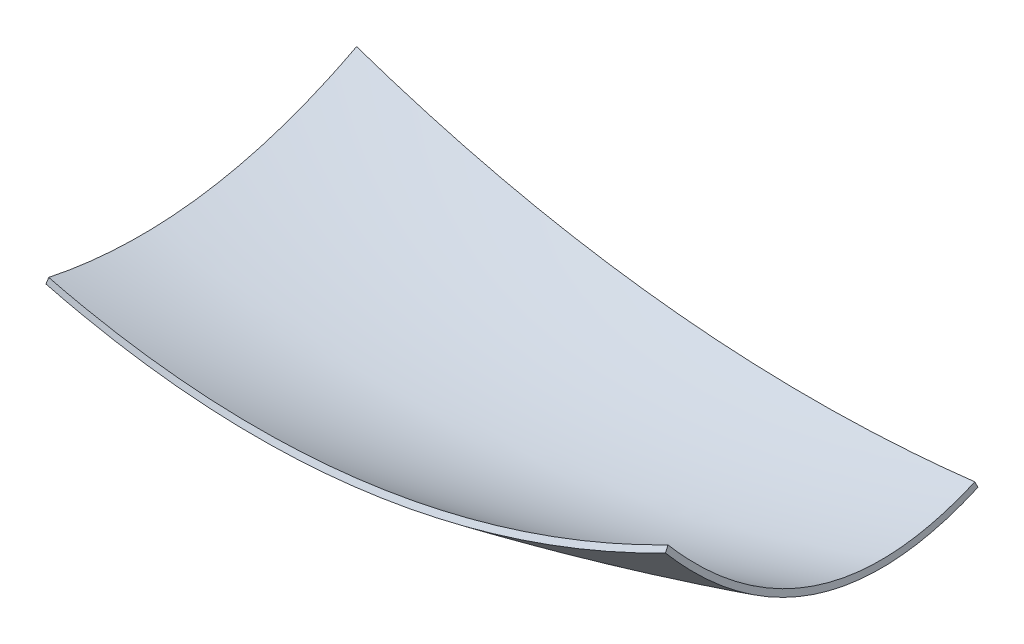
ISO-10303-21;
HEADER;
FILE_DESCRIPTION(('STEP AP214'),'2;1');
FILE_NAME('part.step','',(''),(''),'','','');
FILE_SCHEMA(('AUTOMOTIVE_DESIGN { 1 0 10303 214 1 1 1 1 }'));
ENDSEC;
DATA;
#1=APPLICATION_CONTEXT('core data for automotive mechanical design processes');
#2=APPLICATION_PROTOCOL_DEFINITION('international standard','automotive_design',2000,#1);
#3=PRODUCT_CONTEXT('',#1,'mechanical');
#4=PRODUCT('Part','Part','',(#3));
#5=PRODUCT_RELATED_PRODUCT_CATEGORY('part','',(#4));
#6=PRODUCT_DEFINITION_FORMATION('','',#4);
#7=PRODUCT_DEFINITION_CONTEXT('part definition',#1,'design');
#8=PRODUCT_DEFINITION('design','',#6,#7);
#9=PRODUCT_DEFINITION_SHAPE('','',#8);
#10=(LENGTH_UNIT() NAMED_UNIT(*) SI_UNIT(.MILLI.,.METRE.));
#11=(NAMED_UNIT(*) PLANE_ANGLE_UNIT() SI_UNIT($,.RADIAN.));
#12=(NAMED_UNIT(*) SI_UNIT($,.STERADIAN.) SOLID_ANGLE_UNIT());
#13=UNCERTAINTY_MEASURE_WITH_UNIT(LENGTH_MEASURE(1.E-05),#10,'distance_accuracy_value','');
#14=(GEOMETRIC_REPRESENTATION_CONTEXT(3) GLOBAL_UNCERTAINTY_ASSIGNED_CONTEXT((#13)) GLOBAL_UNIT_ASSIGNED_CONTEXT((#10,
#11,#12)) REPRESENTATION_CONTEXT('',''));
#15=CARTESIAN_POINT('',(0.,0.,0.));
#16=DIRECTION('',(0.,0.,1.));
#17=DIRECTION('',(1.,0.,0.));
#18=AXIS2_PLACEMENT_3D('',#15,#16,#17);
#19=CARTESIAN_POINT('',(-0.240450892228312,-15.9506363595677,100.196147598238));
#20=CARTESIAN_POINT('',(16.667973380551,-20.217375557981,100.244724709791));
#21=CARTESIAN_POINT('',(33.5342554283378,-22.8881582504063,100.298336195862));
#22=CARTESIAN_POINT('',(67.171108901754,-25.0344979123883,100.405103156816));
#23=CARTESIAN_POINT('',(83.941331729766,-24.5101294872349,100.45791102342));
#24=CARTESIAN_POINT('',(134.092025747913,-18.1570760055417,100.600563138446));
#25=CARTESIAN_POINT('',(167.310954500797,-7.55167536274053,100.672080376917));
#26=CARTESIAN_POINT('',(200.314709909604,9.384565928065,100.722633085251));
#27=CARTESIAN_POINT('',(0.240450892228312,-14.0493636404324,99.8038524017619));
#28=CARTESIAN_POINT('',(17.0328303803854,-18.3067969935756,99.7552751392524));
#29=CARTESIAN_POINT('',(33.7754854719089,-20.9874772428553,99.7016638041382));
#30=CARTESIAN_POINT('',(67.1727696557765,-23.1986435770229,99.5948968431844));
#31=CARTESIAN_POINT('',(83.8277479087521,-22.7290551678803,99.5420889765796));
#32=CARTESIAN_POINT('',(133.677053890606,-16.5821086495735,99.3994368615544));
#33=CARTESIAN_POINT('',(166.757322539406,-6.1633300778308,99.3279244513734));
#34=CARTESIAN_POINT('',(199.685290090396,10.615434071935,99.2773669147494));
#35=B_SPLINE_SURFACE_WITH_KNOTS('',1,3,((#19,#20,#21,#22,#23,#24,#25,#26),(#27,#28,#29,#30,#31,
#32,#33,#34)),.UNSPECIFIED.,.F.,.F.,.F.,(2,2),(4,2,2,4),(0.,1.),(0.,0.25,0.5,1.),.UNSPECIFIED.);
#36=CARTESIAN_POINT('',(199.685290090396,10.615434071935,99.2773669147494));
#37=CARTESIAN_POINT('',(200.314709909604,9.384565928065,100.722633085251));
#38=B_SPLINE_CURVE_WITH_KNOTS('',1,(#36,#37),.UNSPECIFIED.,.F.,.F.,(2,2),(0.,1.),.UNSPECIFIED.);
#39=CARTESIAN_POINT('',(199.685290090396,10.615434071935,99.2773669147494));
#40=VERTEX_POINT('',#39);
#41=CARTESIAN_POINT('',(200.314709909546,9.38456587257243,100.722633038015));
#42=VERTEX_POINT('',#41);
#43=EDGE_CURVE('E12',#40,#42,#38,.T.);
#44=CARTESIAN_POINT('',(199.685290090396,10.615434071935,99.2773669147494));
#45=CARTESIAN_POINT('',(166.757322539406,-6.1633300778308,99.3279244513734));
#46=CARTESIAN_POINT('',(133.677053890606,-16.5821086495735,99.3994368615544));
#47=CARTESIAN_POINT('',(83.8277479087521,-22.7290551678803,99.5420889765796));
#48=CARTESIAN_POINT('',(67.1727696557765,-23.1986435770229,99.5948968431844));
#49=CARTESIAN_POINT('',(33.7754854719089,-20.9874772428553,99.7016638041382));
#50=CARTESIAN_POINT('',(17.0328303803854,-18.3067969935756,99.7552751392524));
#51=CARTESIAN_POINT('',(0.240450892228312,-14.0493636404324,99.8038524017619));
#52=B_SPLINE_CURVE_WITH_KNOTS('',3,(#44,#45,#46,#47,#48,#49,#50,#51),.UNSPECIFIED.,.F.,.F.,(4,2,
2,4),(0.,0.5,0.75,1.),.UNSPECIFIED.);
#53=CARTESIAN_POINT('',(0.240450892228312,-14.0493636404324,99.8038524017619));
#54=VERTEX_POINT('',#53);
#55=EDGE_CURVE('E108',#40,#54,#52,.T.);
#56=CARTESIAN_POINT('',(0.240450892228312,-14.0493636404324,99.8038524017619));
#57=CARTESIAN_POINT('',(-0.240450892228312,-15.9506363595677,100.196147598238));
#58=B_SPLINE_CURVE_WITH_KNOTS('',1,(#56,#57),.UNSPECIFIED.,.F.,.F.,(2,2),(0.,1.),.UNSPECIFIED.);
#59=CARTESIAN_POINT('',(-0.240450790777608,-15.9506363851681,100.19614759853));
#60=VERTEX_POINT('',#59);
#61=EDGE_CURVE('E57',#54,#60,#58,.T.);
#62=CARTESIAN_POINT('',(200.31470990957,9.38456592810045,100.722633085295));
#63=CARTESIAN_POINT('',(196.225848411361,7.28624087256167,100.716370100882));
#64=CARTESIAN_POINT('',(192.096388438844,5.26613141934796,100.709764467273));
#65=CARTESIAN_POINT('',(183.829587331551,1.42689544369586,100.69590860702));
#66=CARTESIAN_POINT('',(179.693551012241,-0.395043699056741,100.688671114729));
#67=CARTESIAN_POINT('',(171.413473321552,-3.8379909130129,100.67350437714));
#68=CARTESIAN_POINT('',(167.27054605294,-5.46167181121158,100.665587568204));
#69=CARTESIAN_POINT('',(158.976902402566,-8.5081350081568,100.649023608417));
#70=CARTESIAN_POINT('',(154.827100634811,-9.93340353182142,100.640388184399));
#71=CARTESIAN_POINT('',(146.519858006989,-12.5831099928884,100.622360995433));
#72=CARTESIAN_POINT('',(142.363136289723,-13.8097985223704,100.612979816592));
#73=CARTESIAN_POINT('',(134.042242934901,-16.0624371466394,100.593453229332));
#74=CARTESIAN_POINT('',(129.878604614255,-17.0903538585643,100.583316847237));
#75=CARTESIAN_POINT('',(121.544077106487,-18.9455717639689,100.562295473889));
#76=CARTESIAN_POINT('',(117.373552916014,-19.774509875599,100.551417608118));
#77=CARTESIAN_POINT('',(109.025467200767,-21.2319270540693,100.528957233824));
#78=CARTESIAN_POINT('',(104.848127150694,-21.861672617712,100.517379758537));
#79=CARTESIAN_POINT('',(96.4866316008513,-22.9208992328547,100.493595750127));
#80=CARTESIAN_POINT('',(92.3025855485172,-23.3512429180196,100.48139218522));
#81=CARTESIAN_POINT('',(83.9279023827929,-24.0119026932036,100.456463967275));
#82=CARTESIAN_POINT('',(79.737299601611,-24.2426534316933,100.44374051004));
#83=CARTESIAN_POINT('',(71.3497219054347,-24.5044093583796,100.4179104125));
#84=CARTESIAN_POINT('',(67.152746785232,-24.535407971384,100.404803759595));
#85=CARTESIAN_POINT('',(58.7526260077482,-24.3979894602824,100.378369102123));
#86=CARTESIAN_POINT('',(54.5494877399141,-24.2291230865719,100.365040665535));
#87=CARTESIAN_POINT('',(46.1372207866133,-23.6923426634323,100.338339472178));
#88=CARTESIAN_POINT('',(41.9281485280823,-23.3235471292087,100.324966781769));
#89=CARTESIAN_POINT('',(33.5041362243324,-22.3873328058061,100.298357463925));
#90=CARTESIAN_POINT('',(29.289340048204,-21.8186220988083,100.285122312293));
#91=CARTESIAN_POINT('',(20.8540328065692,-20.4829515451717,100.258964089666));
#92=CARTESIAN_POINT('',(16.6337873558079,-19.7143202737896,100.246044705933));
#93=CARTESIAN_POINT('',(8.18739643212285,-17.9794769489942,100.220666186345));
#94=CARTESIAN_POINT('',(3.96166296785649,-17.0112561173583,100.20821338392));
#95=CARTESIAN_POINT('',(-0.240450790802508,-15.9506363851685,100.196147598497));
#96=B_SPLINE_CURVE_WITH_KNOTS('',3,(#62,#63,#64,#65,#66,#67,#68,#69,#70,#71,#72,#73,#74,#75,#76,
#77,#78,#79,#80,#81,#82,#83,#84,#85,#86,#87,#88,#89,#90,#91,#92,#93,#94,#95),.UNSPECIFIED.,.F.,
.F.,(4,2,2,2,2,2,2,2,2,2,2,2,2,2,2,2,4),(0.,13.7872899990256,27.3423043626341,40.6875803226944,
53.8467186875751,66.8443167378909,79.7058777207261,92.4576972777116,105.12672844843,
117.740428221349,130.326589803202,142.91316567857,155.52808703716,168.199085191354,
180.953520264933,193.818221769434,206.819344841686),.UNSPECIFIED.);
#97=EDGE_CURVE('E241',#42,#60,#96,.T.);
#98=ORIENTED_EDGE('',*,*,#43,.F.);
#99=ORIENTED_EDGE('',*,*,#55,.T.);
#100=ORIENTED_EDGE('',*,*,#61,.T.);
#101=ORIENTED_EDGE('',*,*,#97,.F.);
#102=EDGE_LOOP('',(#98,#99,#100,#101));
#103=FACE_BOUND('',#102,.T.);
#104=ADVANCED_FACE('F43',(#103),#35,.F.);
#105=CARTESIAN_POINT('',(-0.289234933847744,-0.848741702802646,-0.442697046484111));
#106=CARTESIAN_POINT('',(-0.316347178974317,-9.39637203453641,15.9625900201184));
#107=CARTESIAN_POINT('',(-0.331454459415653,-14.9328748732341,32.5583983938536));
#108=CARTESIAN_POINT('',(-0.319035946160587,-19.9703719113374,66.1129181275364));
#109=CARTESIAN_POINT('',(-0.290971228766199,-19.4712665494066,83.0713560778683));
#110=CARTESIAN_POINT('',(-0.240450892228312,-15.9506363595677,100.196147598238));
#111=CARTESIAN_POINT('',(0.289234933847744,0.848741702802646,0.442697046484111));
#112=CARTESIAN_POINT('',(0.316347858508359,-7.62556932409039,16.6719879873977));
#113=CARTESIAN_POINT('',(0.331454459415653,-13.1000367081252,33.060135074685));
#114=CARTESIAN_POINT('',(0.319035946160587,-18.0625396700219,66.1722820076688));
#115=CARTESIAN_POINT('',(0.290970413259953,-17.5506747329086,82.8965530183005));
#116=CARTESIAN_POINT('',(0.240450892228312,-14.0493636404324,99.8038524017619));
#117=B_SPLINE_SURFACE_WITH_KNOTS('',1,3,((#105,#106,#107,#108,#109,#110),(#111,#112,#113,#114,
#115,#116)),.UNSPECIFIED.,.F.,.F.,.F.,(2,2),(4,2,4),(0.,1.),(0.,0.5,1.),.UNSPECIFIED.);
#118=CARTESIAN_POINT('',(0.240450892228312,-14.0493636404324,99.8038524017619));
#119=CARTESIAN_POINT('',(0.290970413259953,-17.5506747329086,82.8965530183005));
#120=CARTESIAN_POINT('',(0.319035946160587,-18.0625396700219,66.1722820076688));
#121=CARTESIAN_POINT('',(0.331454459415653,-13.1000367081252,33.060135074685));
#122=CARTESIAN_POINT('',(0.316347858508359,-7.62556932409039,16.6719879873977));
#123=CARTESIAN_POINT('',(0.289234933847744,0.848741702802646,0.442697046484111));
#124=B_SPLINE_CURVE_WITH_KNOTS('',3,(#118,#119,#120,#121,#122,#123),.UNSPECIFIED.,.F.,.F.,(4,2,
4),(0.,0.5,1.),.UNSPECIFIED.);
#125=CARTESIAN_POINT('',(0.289234933847744,0.848741702802646,0.442697046484111));
#126=VERTEX_POINT('',#125);
#127=EDGE_CURVE('E274',#54,#126,#124,.T.);
#128=CARTESIAN_POINT('',(0.289234933847744,0.848741702802646,0.442697046484111));
#129=CARTESIAN_POINT('',(-0.289234933847744,-0.848741702802646,-0.442697046484111));
#130=B_SPLINE_CURVE_WITH_KNOTS('',1,(#128,#129),.UNSPECIFIED.,.F.,.F.,(2,2),(0.,1.),.UNSPECIFIED.);
#131=CARTESIAN_POINT('',(-0.289234933929082,-0.848741728445857,-0.442696997267637));
#132=VERTEX_POINT('',#131);
#133=EDGE_CURVE('E98',#126,#132,#130,.T.);
#134=CARTESIAN_POINT('',(-0.240450892249539,-15.9506363595662,100.196147598219));
#135=CARTESIAN_POINT('',(-0.24673448112138,-16.3885001999614,98.0668230093687));
#136=CARTESIAN_POINT('',(-0.252718968384161,-16.7818846438879,95.9282350497316));
#137=CARTESIAN_POINT('',(-0.263994123317448,-17.4733829764611,91.6561838504127));
#138=CARTESIAN_POINT('',(-0.269290737930506,-17.7723506723786,89.5228586333515));
#139=CARTESIAN_POINT('',(-0.279175577478166,-18.2750588026449,85.261372117682));
#140=CARTESIAN_POINT('',(-0.28376886913715,-18.4795040921332,83.1332943127297));
#141=CARTESIAN_POINT('',(-0.292241850220066,-18.7933614700195,78.882443055094));
#142=CARTESIAN_POINT('',(-0.29612549610789,-18.9033139575616,76.7597096105247));
#143=CARTESIAN_POINT('',(-0.303180023669967,-19.0283611249287,72.5196438800046));
#144=CARTESIAN_POINT('',(-0.306353601807746,-19.0438207387524,70.4023224227165));
#145=CARTESIAN_POINT('',(-0.311995294466947,-18.9800791620153,66.1731687137843));
#146=CARTESIAN_POINT('',(-0.3144647535844,-18.9010599095089,64.0613337350504));
#147=CARTESIAN_POINT('',(-0.31871130465091,-18.648563300119,59.843220425605));
#148=CARTESIAN_POINT('',(-0.320488364787757,-18.4750816040445,57.73694235462));
#149=CARTESIAN_POINT('',(-0.323368558512627,-18.0338669974491,53.5299912017827));
#150=CARTESIAN_POINT('',(-0.324470324783566,-17.7659445811905,51.4293380102448));
#151=CARTESIAN_POINT('',(-0.326023157703115,-17.1360540911338,47.2336648898516));
#152=CARTESIAN_POINT('',(-0.326471623169962,-16.7737168035838,45.1387004514872));
#153=CARTESIAN_POINT('',(-0.326745306634172,-15.9551964795578,40.9544137358969));
#154=CARTESIAN_POINT('',(-0.326566843483423,-15.4984740226142,38.8651971123707));
#155=CARTESIAN_POINT('',(-0.325617772072122,-14.4913734416823,34.6923970468655));
#156=CARTESIAN_POINT('',(-0.324842597595159,-13.9402987088835,32.6089819602862));
#157=CARTESIAN_POINT('',(-0.32273427477923,-12.7446703067243,28.4477592615672));
#158=CARTESIAN_POINT('',(-0.321395898011356,-12.0992786830822,26.370192752086));
#159=CARTESIAN_POINT('',(-0.318197857930121,-10.7151772046923,22.2206303075222));
#160=CARTESIAN_POINT('',(-0.316332541418188,-9.9755059250763,20.1489555381095));
#161=CARTESIAN_POINT('',(-0.312119196576766,-8.40298752098484,16.0111193553207));
#162=CARTESIAN_POINT('',(-0.309765328206598,-7.56907457816168,13.9453634998128));
#163=CARTESIAN_POINT('',(-0.30461506295662,-5.80819715954404,9.81933528224424));
#164=CARTESIAN_POINT('',(-0.30181287023094,-4.88008198159017,7.75955503550428));
#165=CARTESIAN_POINT('',(-0.295806224763748,-2.93090083090444,3.64530721839388));
#166=CARTESIAN_POINT('',(-0.292596216667505,-1.90861841292519,1.59141544361836));
#167=CARTESIAN_POINT('',(-0.289234933847744,-0.848741702802647,-0.442697046484111));
#168=B_SPLINE_CURVE_WITH_KNOTS('',3,(#134,#135,#136,#137,#138,#139,#140,#141,#142,#143,#144,
#145,#146,#147,#148,#149,#150,#151,#152,#153,#154,#155,#156,#157,#158,#159,#160,#161,#162,#163,
#164,#165,#166,#167),.UNSPECIFIED.,.F.,.F.,(4,2,2,2,2,2,2,2,2,2,2,2,2,2,2,2,4),(0.,
6.52135534117074,12.9819274967348,19.3935135486404,25.7681833299472,32.1182183307067,
38.4560447315841,44.7941622890072,51.1450710660689,57.5211981460807,63.9348264660549,
70.3980277628091,76.9226013551369,83.5200201204097,90.201384602487,96.9773857537946,
103.858276401534),.UNSPECIFIED.);
#169=EDGE_CURVE('E117',#60,#132,#168,.T.);
#170=ORIENTED_EDGE('',*,*,#61,.F.);
#171=ORIENTED_EDGE('',*,*,#127,.T.);
#172=ORIENTED_EDGE('',*,*,#133,.T.);
#173=ORIENTED_EDGE('',*,*,#169,.F.);
#174=EDGE_LOOP('',(#170,#171,#172,#173));
#175=FACE_BOUND('',#174,.T.);
#176=ADVANCED_FACE('F141',(#175),#117,.F.);
#177=CARTESIAN_POINT('',(-0.289234933847744,-0.848741702802646,-0.442697046484111));
#178=CARTESIAN_POINT('',(32.7105142481926,-12.0776672162289,-0.474824911043054));
#179=CARTESIAN_POINT('',(65.9088506199869,-19.5295880734227,-0.487661330814));
#180=CARTESIAN_POINT('',(132.705623056005,-26.8842454152936,-0.474967277200345));
#181=CARTESIAN_POINT('',(166.304431199708,-26.787263000037,-0.449381151782209));
#182=CARTESIAN_POINT('',(200.105063823266,-22.9109404311503,-0.398934987105015));
#183=CARTESIAN_POINT('',(0.289234933847744,0.848741702802646,0.442697046484111));
#184=CARTESIAN_POINT('',(33.1602576938958,-10.3698315525799,0.474824828660262));
#185=CARTESIAN_POINT('',(66.2306407639982,-17.8083268577765,0.487661330814));
#186=CARTESIAN_POINT('',(132.767201661314,-25.1203361825723,0.474967277200345));
#187=CARTESIAN_POINT('',(166.233007438638,-24.9935690396506,0.449380823359991));
#188=CARTESIAN_POINT('',(199.894936176734,-21.0890595688497,0.398934987105015));
#189=B_SPLINE_SURFACE_WITH_KNOTS('',1,3,((#177,#178,#179,#180,#181,#182),(#183,#184,#185,#186,
#187,#188)),.UNSPECIFIED.,.F.,.F.,.F.,(2,2),(4,2,4),(0.,1.),(0.,0.5,1.),.UNSPECIFIED.);
#190=CARTESIAN_POINT('',(0.289234933847744,0.848741702802646,0.442697046484111));
#191=CARTESIAN_POINT('',(33.1602576938958,-10.3698315525799,0.474824828660262));
#192=CARTESIAN_POINT('',(66.2306407639982,-17.8083268577765,0.487661330814));
#193=CARTESIAN_POINT('',(132.767201661314,-25.1203361825723,0.474967277200345));
#194=CARTESIAN_POINT('',(166.233007438638,-24.9935690396506,0.449380823359991));
#195=CARTESIAN_POINT('',(199.894936176734,-21.0890595688497,0.398934987105015));
#196=B_SPLINE_CURVE_WITH_KNOTS('',3,(#190,#191,#192,#193,#194,#195),.UNSPECIFIED.,.F.,.F.,(4,2,
4),(0.,0.5,1.),.UNSPECIFIED.);
#197=CARTESIAN_POINT('',(199.894936176734,-21.0890595688497,0.398934987105015));
#198=VERTEX_POINT('',#197);
#199=EDGE_CURVE('E106',#126,#198,#196,.T.);
#200=CARTESIAN_POINT('',(199.894936176734,-21.0890595688497,0.398934987105015));
#201=CARTESIAN_POINT('',(200.105063823266,-22.9109404311503,-0.398934987105015));
#202=B_SPLINE_CURVE_WITH_KNOTS('',1,(#200,#201),.UNSPECIFIED.,.F.,.F.,(2,2),(0.,1.),.UNSPECIFIED.);
#203=CARTESIAN_POINT('',(200.105063823381,-22.9109404545827,-0.398934933568342));
#204=VERTEX_POINT('',#203);
#205=EDGE_CURVE('E86',#198,#204,#202,.T.);
#206=CARTESIAN_POINT('',(-0.289234933847744,-0.848741702802647,-0.442697046484111));
#207=CARTESIAN_POINT('',(3.82109426534785,-2.2473944810153,-0.44669878450894));
#208=CARTESIAN_POINT('',(7.94947416489801,-3.59248909022675,-0.450409769575753));
#209=CARTESIAN_POINT('',(16.2126737567365,-6.16390529390171,-0.457220421770713));
#210=CARTESIAN_POINT('',(20.3472643616851,-7.39096329319814,-0.460324023756114));
#211=CARTESIAN_POINT('',(32.7260097664609,-10.8841572480732,-0.468704497105304));
#212=CARTESIAN_POINT('',(41.0170284741553,-12.9868246778691,-0.473121034379433));
#213=CARTESIAN_POINT('',(57.6249326733863,-16.7150251004494,-0.479553708763889));
#214=CARTESIAN_POINT('',(65.9408701648761,-18.3447900438647,-0.481591663043408));
#215=CARTESIAN_POINT('',(82.5986122566161,-21.1286353143795,-0.483259519038789));
#216=CARTESIAN_POINT('',(90.9399271156251,-22.2856363191629,-0.482904450671002));
#217=CARTESIAN_POINT('',(107.647948611145,-24.1252686093892,-0.479729212083859));
#218=CARTESIAN_POINT('',(116.014490245725,-24.8093961270015,-0.476916881501954));
#219=CARTESIAN_POINT('',(132.772612742679,-25.7047279770272,-0.468719574196784));
#220=CARTESIAN_POINT('',(141.164193269718,-25.9159386148143,-0.463334631775167));
#221=CARTESIAN_POINT('',(157.97289322968,-25.8667583921768,-0.449835983564949));
#222=CARTESIAN_POINT('',(166.390009519164,-25.6048742780862,-0.441713703619853));
#223=CARTESIAN_POINT('',(179.012195946345,-24.8607751467165,-0.427367537458308));
#224=CARTESIAN_POINT('',(183.228269877669,-24.5531313052548,-0.422211297820397));
#225=CARTESIAN_POINT('',(191.666754115364,-23.8202013623076,-0.411142742955453));
#226=CARTESIAN_POINT('',(195.889124996047,-23.3944610872396,-0.40522755716167));
#227=CARTESIAN_POINT('',(200.105063823277,-22.9109404311275,-0.398934987154219));
#228=B_SPLINE_CURVE_WITH_KNOTS('',3,(#206,#207,#208,#209,#210,#211,#212,#213,#214,#215,#216,
#217,#218,#219,#220,#221,#222,#223,#224,#225,#226,#227),.UNSPECIFIED.,.F.,.F.,(4,2,2,2,2,2,2,2,
2,2,4),(0.,13.0246061735627,25.9618172942494,51.6086677703219,77.0183804710459,102.268651146859,
127.438656428018,152.608326116929,177.857579001395,190.538052910407,203.267985952688),.UNSPECIFIED.);
#229=EDGE_CURVE('E99',#132,#204,#228,.T.);
#230=ORIENTED_EDGE('',*,*,#133,.F.);
#231=ORIENTED_EDGE('',*,*,#199,.T.);
#232=ORIENTED_EDGE('',*,*,#205,.T.);
#233=ORIENTED_EDGE('',*,*,#229,.F.);
#234=EDGE_LOOP('',(#230,#231,#232,#233));
#235=FACE_BOUND('',#234,.T.);
#236=ADVANCED_FACE('F113',(#235),#189,.T.);
#237=CARTESIAN_POINT('',(200.105063823266,-22.9109404311503,-0.398934987105015));
#238=CARTESIAN_POINT('',(200.12427426062,-26.8160649336257,8.52320580030753));
#239=CARTESIAN_POINT('',(200.147396985477,-29.0795275175004,17.3448243095272));
#240=CARTESIAN_POINT('',(200.194109593273,-30.2894181380685,34.7564841421142));
#241=CARTESIAN_POINT('',(200.217052897054,-29.2346148388965,43.3443980365698));
#242=CARTESIAN_POINT('',(200.254870326946,-23.8206077604866,60.2330405883778));
#243=CARTESIAN_POINT('',(200.269907250058,-19.4640268024272,68.5331313114066));
#244=CARTESIAN_POINT('',(200.29488156225,-7.48580568920374,84.8409026493506));
#245=CARTESIAN_POINT('',(200.305072598553,0.135987309860678,92.8502320598398));
#246=CARTESIAN_POINT('',(200.314709909604,9.384565928065,100.722633085251));
#247=CARTESIAN_POINT('',(199.894936176734,-21.0890595688497,0.398934987105015));
#248=CARTESIAN_POINT('',(199.875722964287,-24.9186559230341,9.13849319370989));
#249=CARTESIAN_POINT('',(199.852603014523,-27.1229007199023,17.7298170391096));
#250=CARTESIAN_POINT('',(199.805890406727,-28.3143976635642,34.646523691458));
#251=CARTESIAN_POINT('',(199.782947102946,-27.3028811871271,42.9740347515695));
#252=CARTESIAN_POINT('',(199.745129673054,-22.0502215988704,59.4187255330948));
#253=CARTESIAN_POINT('',(199.730092749942,-17.8064556658722,67.5365431888322));
#254=CARTESIAN_POINT('',(199.70511843775,-6.04995588153227,83.5670720326195));
#255=CARTESIAN_POINT('',(199.694927782748,1.4626252470796,91.4781343622328));
#256=CARTESIAN_POINT('',(199.685290090396,10.615434071935,99.2773669147494));
#257=B_SPLINE_SURFACE_WITH_KNOTS('',1,3,((#237,#238,#239,#240,#241,#242,#243,#244,#245,#246),
(#247,#248,#249,#250,#251,#252,#253,#254,#255,#256)),.UNSPECIFIED.,.F.,.F.,.F.,(2,2),(4,2,2,2,
4),(0.,1.),(0.,0.25,0.5,0.75,1.),.UNSPECIFIED.);
#258=CARTESIAN_POINT('',(199.894936176734,-21.0890595688497,0.398934987105015));
#259=CARTESIAN_POINT('',(199.875722964287,-24.9186559230341,9.13849319370989));
#260=CARTESIAN_POINT('',(199.852603014523,-27.1229007199023,17.7298170391096));
#261=CARTESIAN_POINT('',(199.805890406727,-28.3143976635642,34.646523691458));
#262=CARTESIAN_POINT('',(199.782947102946,-27.3028811871271,42.9740347515695));
#263=CARTESIAN_POINT('',(199.745129673054,-22.0502215988704,59.4187255330948));
#264=CARTESIAN_POINT('',(199.730092749942,-17.8064556658722,67.5365431888322));
#265=CARTESIAN_POINT('',(199.70511843775,-6.04995588153227,83.5670720326195));
#266=CARTESIAN_POINT('',(199.694927782748,1.4626252470796,91.4781343622328));
#267=CARTESIAN_POINT('',(199.685290090396,10.615434071935,99.2773669147494));
#268=B_SPLINE_CURVE_WITH_KNOTS('',3,(#258,#259,#260,#261,#262,#263,#264,#265,#266,#267),
.UNSPECIFIED.,.F.,.F.,(4,2,2,2,4),(0.,0.25,0.5,0.75,1.),.UNSPECIFIED.);
#269=EDGE_CURVE('E88',#198,#40,#268,.T.);
#270=CARTESIAN_POINT('',(200.105063823277,-22.9109404311275,-0.398934987154219));
#271=CARTESIAN_POINT('',(200.107441907051,-23.3944936593441,0.705828968660073));
#272=CARTESIAN_POINT('',(200.109898295316,-23.8575371546059,1.81969168525016));
#273=CARTESIAN_POINT('',(200.114917519408,-24.7314283473388,4.04446111792675));
#274=CARTESIAN_POINT('',(200.117477626313,-25.1430686342378,5.15505690653546));
#275=CARTESIAN_POINT('',(200.122696107765,-25.9141222855495,7.37329411551453));
#276=CARTESIAN_POINT('',(200.125352095092,-26.2742997422147,8.48066914581118));
#277=CARTESIAN_POINT('',(200.130750540618,-26.9423862178769,10.6923693747711));
#278=CARTESIAN_POINT('',(200.133491018299,-27.2510193805716,11.7964754064311));
#279=CARTESIAN_POINT('',(200.139044459637,-27.8159941890342,14.0015488203338));
#280=CARTESIAN_POINT('',(200.141855871091,-28.0730075012085,15.1023436897119));
#281=CARTESIAN_POINT('',(200.147534850953,-28.5347343680405,17.3006867795118));
#282=CARTESIAN_POINT('',(200.150401297438,-28.7400544707913,18.3981072800815));
#283=CARTESIAN_POINT('',(200.156172126377,-29.098406148125,20.5895835545533));
#284=CARTESIAN_POINT('',(200.159075789012,-29.2519667831389,21.6835525695858));
#285=CARTESIAN_POINT('',(200.164901425409,-29.5068321295913,23.8679988696585));
#286=CARTESIAN_POINT('',(200.167823024121,-29.6085769308457,24.958424639669));
#287=CARTESIAN_POINT('',(200.173664155196,-29.7598662660856,27.1356528520304));
#288=CARTESIAN_POINT('',(200.176583573189,-29.8097519255621,28.2224314895943));
#289=CARTESIAN_POINT('',(200.182399948129,-29.8574021416696,30.3922336184826));
#290=CARTESIAN_POINT('',(200.185296946981,-29.8554009394059,31.4752519181237));
#291=CARTESIAN_POINT('',(200.191048846084,-29.7993793507831,33.6374062175104));
#292=CARTESIAN_POINT('',(200.193903829132,-29.7454809709208,34.716545365463));
#293=CARTESIAN_POINT('',(200.199553563209,-29.5857876212496,36.8708236924755));
#294=CARTESIAN_POINT('',(200.202348322707,-29.4799999978845,37.9459634160664));
#295=CARTESIAN_POINT('',(200.207861637023,-29.2166681171955,40.0921391153061));
#296=CARTESIAN_POINT('',(200.210580022189,-29.0590172163291,41.1631619958979));
#297=CARTESIAN_POINT('',(200.21592728864,-28.6921117649583,43.3010177271287));
#298=CARTESIAN_POINT('',(200.218555739457,-28.4826403114156,44.3678133096319));
#299=CARTESIAN_POINT('',(200.223712844403,-28.0122547482221,46.4971481869312));
#300=CARTESIAN_POINT('',(200.226240752292,-27.7510200295051,47.5596165616938));
#301=CARTESIAN_POINT('',(200.231189623888,-27.1772716350153,49.6802520776103));
#302=CARTESIAN_POINT('',(200.233609501193,-26.8643426086298,50.7383066795192));
#303=CARTESIAN_POINT('',(200.23833826272,-26.1873668269293,52.8500910441501));
#304=CARTESIAN_POINT('',(200.24064572553,-25.8228208157805,53.9036605156222));
#305=CARTESIAN_POINT('',(200.245148501388,-25.0427651392806,56.0064712363626));
#306=CARTESIAN_POINT('',(200.247342088468,-24.6266844126525,57.0555003142477));
#307=CARTESIAN_POINT('',(200.25161852096,-23.743702316828,59.1492450380286));
#308=CARTESIAN_POINT('',(200.253699385234,-23.276170825843,60.1936945273782));
#309=CARTESIAN_POINT('',(200.257753940012,-22.290416184021,62.2783103273265));
#310=CARTESIAN_POINT('',(200.25972545527,-21.7715166648611,63.3181562993655));
#311=CARTESIAN_POINT('',(200.263566599291,-20.6831389501385,65.3936077088016));
#312=CARTESIAN_POINT('',(200.265433924414,-20.1129505276593,66.4288401190121));
#313=CARTESIAN_POINT('',(200.269073255268,-18.9220909983822,68.4951162396492));
#314=CARTESIAN_POINT('',(200.270842893344,-18.3006873777742,69.5257371317888));
#315=CARTESIAN_POINT('',(200.274294286201,-17.0074762415642,71.5828482676928));
#316=CARTESIAN_POINT('',(200.27597366788,-16.3349244017279,72.6088698877216));
#317=CARTESIAN_POINT('',(200.27925248778,-14.9394791584418,74.6568436533845));
#318=CARTESIAN_POINT('',(200.280849597309,-14.2158388375202,75.6782861158736));
#319=CARTESIAN_POINT('',(200.283972013639,-12.7182627624862,77.7171647055231));
#320=CARTESIAN_POINT('',(200.285495076023,-11.9435853611694,78.7340553302282));
#321=CARTESIAN_POINT('',(200.288477476019,-10.3439695495562,80.7638886524518));
#322=CARTESIAN_POINT('',(200.289934682727,-9.518301359428,81.7762553732435));
#323=CARTESIAN_POINT('',(200.292793259018,-7.81671641800179,83.7971113126473));
#324=CARTESIAN_POINT('',(200.294192632214,-6.94008681634829,84.8049998229093));
#325=CARTESIAN_POINT('',(200.296942861478,-5.13661706142629,86.8169102023931));
#326=CARTESIAN_POINT('',(200.29829186279,-4.2090859256881,87.8203105907803));
#327=CARTESIAN_POINT('',(200.302324289192,-1.31743319437823,90.8603444857593));
#328=CARTESIAN_POINT('',(200.304890015234,0.693261691325615,92.8529830051994));
#329=CARTESIAN_POINT('',(200.308611443575,3.82018482139831,95.7969931309273));
#330=CARTESIAN_POINT('',(200.309850623722,4.90034080577536,96.7872565393776));
#331=CARTESIAN_POINT('',(200.312305112218,7.11097344648377,98.7641190505199));
#332=CARTESIAN_POINT('',(200.313519140154,8.24203573808912,99.7500636732597));
#333=CARTESIAN_POINT('',(200.31470990957,9.38456592810045,100.722633085295));
#334=B_SPLINE_CURVE_WITH_KNOTS('',3,(#270,#271,#272,#273,#274,#275,#276,#277,#278,#279,#280,
#281,#282,#283,#284,#285,#286,#287,#288,#289,#290,#291,#292,#293,#294,#295,#296,#297,#298,#299,
#300,#301,#302,#303,#304,#305,#306,#307,#308,#309,#310,#311,#312,#313,#314,#315,#316,#317,#318,
#319,#320,#321,#322,#323,#324,#325,#326,#327,#328,#329,#330,#331,#332,#333),.UNSPECIFIED.,.F.,
.F.,(4,2,2,2,2,2,2,2,2,2,2,2,2,2,2,2,2,2,2,2,2,2,2,2,2,2,2,2,2,2,2,4),(0.,3.61782593255753,
7.17021585117778,10.6626606782699,14.1009288005306,17.4910550825435,20.8393246367117,
24.152251158302,27.4365498620288,30.6991053053549,33.946934651427,37.1871471818928,
40.4269010976329,43.6733588166306,46.9336420840005,50.2147882235679,53.5237087984876,
56.8671517949386,60.2516682337052,63.683583855078,67.1689762439567,70.7136574936088,
74.3231622630279,78.0027408799297,81.7573569975443,85.5916892151158,89.5101360289312,
93.5168234781439,97.6156148769804,106.102912396566,110.498743086143,114.999742224511),.UNSPECIFIED.);
#335=EDGE_CURVE('E91',#204,#42,#334,.T.);
#336=ORIENTED_EDGE('',*,*,#269,.T.);
#337=ORIENTED_EDGE('',*,*,#43,.T.);
#338=ORIENTED_EDGE('',*,*,#335,.F.);
#339=ORIENTED_EDGE('',*,*,#205,.F.);
#340=EDGE_LOOP('',(#336,#337,#338,#339));
#341=FACE_BOUND('',#340,.T.);
#342=ADVANCED_FACE('F45',(#341),#257,.T.);
#343=CARTESIAN_POINT('',(0.,0.,0.));
#344=CARTESIAN_POINT('',(0.,-17.0219410542395,32.6345778679146));
#345=CARTESIAN_POINT('',(0.,-22.0219410542395,65.9679112012479));
#346=CARTESIAN_POINT('',(0.,-15.,100.));
#347=CARTESIAN_POINT('',(65.8707720337679,-22.4474988430217,0.));
#348=CARTESIAN_POINT('',(66.3810509051456,-42.3744445273161,33.5308517907888));
#349=CARTESIAN_POINT('',(66.8913297765233,-45.5747266881863,66.8641851241222));
#350=CARTESIAN_POINT('',(67.401608647901,-32.0483453256324,100.));
#351=CARTESIAN_POINT('',(132.537438700435,-29.780832176355,0.));
#352=CARTESIAN_POINT('',(133.047717571812,-49.1902781076119,34.4271257136631));
#353=CARTESIAN_POINT('',(133.55799644319,-47.1683380462599,67.7604590469964));
#354=CARTESIAN_POINT('',(134.068275314568,-23.715011992299,100.));
#355=CARTESIAN_POINT('',(200.,-22.,0.));
#356=CARTESIAN_POINT('',(200.,-37.4694417951269,35.3233996365373));
#357=CARTESIAN_POINT('',(200.,-26.8027751284602,68.6567329698707));
#358=CARTESIAN_POINT('',(200.,10.,100.));
#359=B_SPLINE_SURFACE_WITH_KNOTS('',3,3,((#343,#344,#345,#346),(#347,#348,#349,#350),(#351,#352,
#353,#354),(#355,#356,#357,#358)),.UNSPECIFIED.,.F.,.F.,.F.,(4,4),(4,4),(0.,1.),(0.,1.),.UNSPECIFIED.);
#360=OFFSET_SURFACE('',#359,1.,.F.);
#361=ORIENTED_EDGE('',*,*,#229,.T.);
#362=ORIENTED_EDGE('',*,*,#335,.T.);
#363=ORIENTED_EDGE('',*,*,#97,.T.);
#364=ORIENTED_EDGE('',*,*,#169,.T.);
#365=EDGE_LOOP('',(#361,#362,#363,#364));
#366=FACE_BOUND('',#365,.T.);
#367=ADVANCED_FACE('F209',(#366),#360,.T.);
#368=CARTESIAN_POINT('',(0.,0.,0.));
#369=CARTESIAN_POINT('',(0.,-17.0219410542395,32.6345778679146));
#370=CARTESIAN_POINT('',(0.,-22.0219410542395,65.9679112012479));
#371=CARTESIAN_POINT('',(0.,-15.,100.));
#372=CARTESIAN_POINT('',(65.8707720337679,-22.4474988430217,0.));
#373=CARTESIAN_POINT('',(66.3810509051456,-42.3744445273161,33.5308517907888));
#374=CARTESIAN_POINT('',(66.8913297765233,-45.5747266881863,66.8641851241222));
#375=CARTESIAN_POINT('',(67.401608647901,-32.0483453256324,100.));
#376=CARTESIAN_POINT('',(132.537438700435,-29.780832176355,0.));
#377=CARTESIAN_POINT('',(133.047717571812,-49.1902781076119,34.4271257136631));
#378=CARTESIAN_POINT('',(133.55799644319,-47.1683380462599,67.7604590469964));
#379=CARTESIAN_POINT('',(134.068275314568,-23.715011992299,100.));
#380=CARTESIAN_POINT('',(200.,-22.,0.));
#381=CARTESIAN_POINT('',(200.,-37.4694417951269,35.3233996365373));
#382=CARTESIAN_POINT('',(200.,-26.8027751284602,68.6567329698707));
#383=CARTESIAN_POINT('',(200.,10.,100.));
#384=B_SPLINE_SURFACE_WITH_KNOTS('',3,3,((#368,#369,#370,#371),(#372,#373,#374,#375),(#376,#377,
#378,#379),(#380,#381,#382,#383)),.UNSPECIFIED.,.F.,.F.,.F.,(4,4),(4,4),(0.,1.),(0.,1.),.UNSPECIFIED.);
#385=OFFSET_SURFACE('',#384,-1.,.F.);
#386=ORIENTED_EDGE('',*,*,#199,.F.);
#387=ORIENTED_EDGE('',*,*,#127,.F.);
#388=ORIENTED_EDGE('',*,*,#55,.F.);
#389=ORIENTED_EDGE('',*,*,#269,.F.);
#390=EDGE_LOOP('',(#386,#387,#388,#389));
#391=FACE_BOUND('',#390,.T.);
#392=ADVANCED_FACE('F104',(#391),#385,.F.);
#393=CLOSED_SHELL('',(#104,#176,#236,#342,#367,#392));
#394=MANIFOLD_SOLID_BREP('B2',#393);
#395=ADVANCED_BREP_SHAPE_REPRESENTATION('',(#18,#394),#14);
#396=SHAPE_DEFINITION_REPRESENTATION(#9,#395);
ENDSEC;
END-ISO-10303-21;
